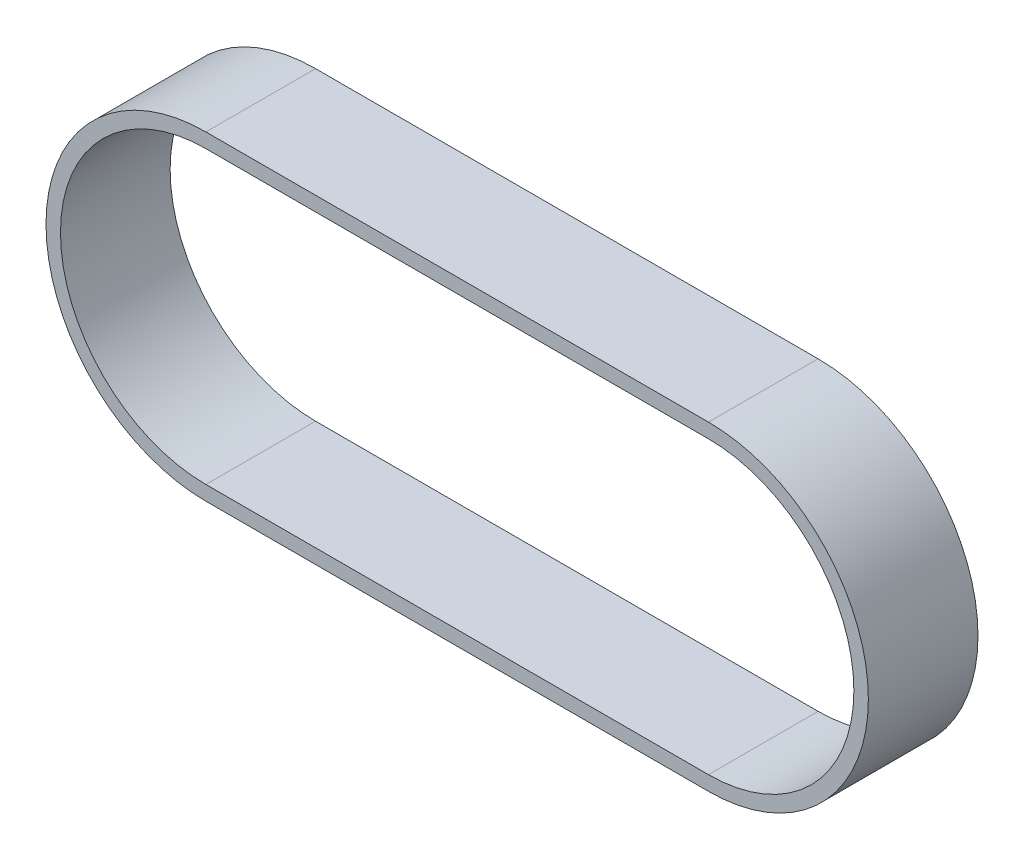
ISO-10303-21;
HEADER;
FILE_DESCRIPTION(('STEP AP214'),'2;1');
FILE_NAME('part.step','',(''),(''),'','','');
FILE_SCHEMA(('AUTOMOTIVE_DESIGN { 1 0 10303 214 1 1 1 1 }'));
ENDSEC;
DATA;
#1=APPLICATION_CONTEXT('core data for automotive mechanical design processes');
#2=APPLICATION_PROTOCOL_DEFINITION('international standard','automotive_design',2000,#1);
#3=PRODUCT_CONTEXT('',#1,'mechanical');
#4=PRODUCT('Part','Part','',(#3));
#5=PRODUCT_RELATED_PRODUCT_CATEGORY('part','',(#4));
#6=PRODUCT_DEFINITION_FORMATION('','',#4);
#7=PRODUCT_DEFINITION_CONTEXT('part definition',#1,'design');
#8=PRODUCT_DEFINITION('design','',#6,#7);
#9=PRODUCT_DEFINITION_SHAPE('','',#8);
#10=(LENGTH_UNIT() NAMED_UNIT(*) SI_UNIT(.MILLI.,.METRE.));
#11=(NAMED_UNIT(*) PLANE_ANGLE_UNIT() SI_UNIT($,.RADIAN.));
#12=(NAMED_UNIT(*) SI_UNIT($,.STERADIAN.) SOLID_ANGLE_UNIT());
#13=UNCERTAINTY_MEASURE_WITH_UNIT(LENGTH_MEASURE(1.E-05),#10,'distance_accuracy_value','');
#14=(GEOMETRIC_REPRESENTATION_CONTEXT(3) GLOBAL_UNCERTAINTY_ASSIGNED_CONTEXT((#13)) GLOBAL_UNIT_ASSIGNED_CONTEXT((#10,
#11,#12)) REPRESENTATION_CONTEXT('',''));
#15=CARTESIAN_POINT('',(0.,0.,0.));
#16=DIRECTION('',(0.,0.,1.));
#17=DIRECTION('',(1.,0.,0.));
#18=AXIS2_PLACEMENT_3D('',#15,#16,#17);
#19=CARTESIAN_POINT('',(0.,0.,12.));
#20=DIRECTION('',(0.,0.,1.));
#21=DIRECTION('',(1.,0.,0.));
#22=AXIS2_PLACEMENT_3D('',#19,#20,#21);
#23=PLANE('',#22);
#24=CARTESIAN_POINT('',(0.,0.,12.));
#25=DIRECTION('',(0.,0.,1.));
#26=DIRECTION('',(1.,0.,0.));
#27=AXIS2_PLACEMENT_3D('',#24,#25,#26);
#28=CIRCLE('',#27,17.5);
#29=CARTESIAN_POINT('',(0.,17.5,12.));
#30=VERTEX_POINT('',#29);
#31=CARTESIAN_POINT('',(0.,-17.5,12.));
#32=VERTEX_POINT('',#31);
#33=EDGE_CURVE('E134',#30,#32,#28,.T.);
#34=ORIENTED_EDGE('',*,*,#33,.T.);
#35=DIRECTION('',(1.,0.,0.));
#36=VECTOR('',#35,1.);
#37=CARTESIAN_POINT('',(0.,-17.5,12.));
#38=LINE('',#37,#36);
#39=CARTESIAN_POINT('',(55.,-17.5,12.));
#40=VERTEX_POINT('',#39);
#41=EDGE_CURVE('E137',#32,#40,#38,.T.);
#42=ORIENTED_EDGE('',*,*,#41,.T.);
#43=CARTESIAN_POINT('',(55.,0.,12.));
#44=DIRECTION('',(0.,0.,1.));
#45=DIRECTION('',(1.,0.,0.));
#46=AXIS2_PLACEMENT_3D('',#43,#44,#45);
#47=CIRCLE('',#46,17.5);
#48=CARTESIAN_POINT('',(55.,17.5,12.));
#49=VERTEX_POINT('',#48);
#50=EDGE_CURVE('E140',#40,#49,#47,.T.);
#51=ORIENTED_EDGE('',*,*,#50,.T.);
#52=DIRECTION('',(-1.,0.,0.));
#53=VECTOR('',#52,1.);
#54=CARTESIAN_POINT('',(0.,17.5,12.));
#55=LINE('',#54,#53);
#56=EDGE_CURVE('E142',#49,#30,#55,.T.);
#57=ORIENTED_EDGE('',*,*,#56,.T.);
#58=EDGE_LOOP('',(#34,#42,#51,#57));
#59=FACE_BOUND('',#58,.T.);
#60=DIRECTION('',(1.,0.,0.));
#61=VECTOR('',#60,1.);
#62=CARTESIAN_POINT('',(0.,-15.915,12.));
#63=LINE('',#62,#61);
#64=CARTESIAN_POINT('',(0.,-15.915,12.));
#65=VERTEX_POINT('',#64);
#66=CARTESIAN_POINT('',(55.,-15.915,12.));
#67=VERTEX_POINT('',#66);
#68=EDGE_CURVE('E106',#65,#67,#63,.T.);
#69=ORIENTED_EDGE('',*,*,#68,.F.);
#70=CARTESIAN_POINT('',(0.,0.,12.));
#71=DIRECTION('',(0.,0.,1.));
#72=DIRECTION('',(1.,0.,0.));
#73=AXIS2_PLACEMENT_3D('',#70,#71,#72);
#74=CIRCLE('',#73,15.915);
#75=CARTESIAN_POINT('',(0.,15.915,12.));
#76=VERTEX_POINT('',#75);
#77=EDGE_CURVE('E98',#76,#65,#74,.T.);
#78=ORIENTED_EDGE('',*,*,#77,.F.);
#79=DIRECTION('',(-1.,0.,0.));
#80=VECTOR('',#79,1.);
#81=CARTESIAN_POINT('',(0.,15.915,12.));
#82=LINE('',#81,#80);
#83=CARTESIAN_POINT('',(55.,15.915,12.));
#84=VERTEX_POINT('',#83);
#85=EDGE_CURVE('E120',#84,#76,#82,.T.);
#86=ORIENTED_EDGE('',*,*,#85,.F.);
#87=CARTESIAN_POINT('',(55.,0.,12.));
#88=DIRECTION('',(0.,0.,1.));
#89=DIRECTION('',(1.,0.,0.));
#90=AXIS2_PLACEMENT_3D('',#87,#88,#89);
#91=CIRCLE('',#90,15.915);
#92=EDGE_CURVE('E118',#67,#84,#91,.T.);
#93=ORIENTED_EDGE('',*,*,#92,.F.);
#94=EDGE_LOOP('',(#69,#78,#86,#93));
#95=FACE_BOUND('',#94,.T.);
#96=ADVANCED_FACE('F33',(#59,#95),#23,.T.);
#97=CARTESIAN_POINT('',(0.,0.,0.));
#98=DIRECTION('',(0.,0.,1.));
#99=DIRECTION('',(1.,0.,0.));
#100=AXIS2_PLACEMENT_3D('',#97,#98,#99);
#101=PLANE('',#100);
#102=CARTESIAN_POINT('',(0.,0.,0.));
#103=DIRECTION('',(0.,0.,1.));
#104=DIRECTION('',(1.,0.,0.));
#105=AXIS2_PLACEMENT_3D('',#102,#103,#104);
#106=CIRCLE('',#105,17.5);
#107=CARTESIAN_POINT('',(0.,17.5,0.));
#108=VERTEX_POINT('',#107);
#109=CARTESIAN_POINT('',(0.,-17.5,0.));
#110=VERTEX_POINT('',#109);
#111=EDGE_CURVE('E114',#108,#110,#106,.T.);
#112=ORIENTED_EDGE('',*,*,#111,.F.);
#113=DIRECTION('',(-1.,0.,0.));
#114=VECTOR('',#113,1.);
#115=CARTESIAN_POINT('',(0.,17.5,0.));
#116=LINE('',#115,#114);
#117=CARTESIAN_POINT('',(55.,17.5,0.));
#118=VERTEX_POINT('',#117);
#119=EDGE_CURVE('E138',#118,#108,#116,.T.);
#120=ORIENTED_EDGE('',*,*,#119,.F.);
#121=CARTESIAN_POINT('',(55.,0.,0.));
#122=DIRECTION('',(0.,0.,1.));
#123=DIRECTION('',(1.,0.,0.));
#124=AXIS2_PLACEMENT_3D('',#121,#122,#123);
#125=CIRCLE('',#124,17.5);
#126=CARTESIAN_POINT('',(55.,-17.5,0.));
#127=VERTEX_POINT('',#126);
#128=EDGE_CURVE('E149',#127,#118,#125,.T.);
#129=ORIENTED_EDGE('',*,*,#128,.F.);
#130=DIRECTION('',(1.,0.,0.));
#131=VECTOR('',#130,1.);
#132=CARTESIAN_POINT('',(0.,-17.5,0.));
#133=LINE('',#132,#131);
#134=EDGE_CURVE('E147',#110,#127,#133,.T.);
#135=ORIENTED_EDGE('',*,*,#134,.F.);
#136=EDGE_LOOP('',(#112,#120,#129,#135));
#137=FACE_BOUND('',#136,.T.);
#138=CARTESIAN_POINT('',(0.,0.,0.));
#139=DIRECTION('',(0.,0.,1.));
#140=DIRECTION('',(1.,0.,0.));
#141=AXIS2_PLACEMENT_3D('',#138,#139,#140);
#142=CIRCLE('',#141,15.915);
#143=CARTESIAN_POINT('',(0.,15.915,0.));
#144=VERTEX_POINT('',#143);
#145=CARTESIAN_POINT('',(0.,-15.915,0.));
#146=VERTEX_POINT('',#145);
#147=EDGE_CURVE('E56',#144,#146,#142,.T.);
#148=ORIENTED_EDGE('',*,*,#147,.T.);
#149=DIRECTION('',(1.,0.,0.));
#150=VECTOR('',#149,1.);
#151=CARTESIAN_POINT('',(0.,-15.915,0.));
#152=LINE('',#151,#150);
#153=CARTESIAN_POINT('',(55.,-15.915,0.));
#154=VERTEX_POINT('',#153);
#155=EDGE_CURVE('E113',#146,#154,#152,.T.);
#156=ORIENTED_EDGE('',*,*,#155,.T.);
#157=CARTESIAN_POINT('',(55.,0.,0.));
#158=DIRECTION('',(0.,0.,1.));
#159=DIRECTION('',(1.,0.,0.));
#160=AXIS2_PLACEMENT_3D('',#157,#158,#159);
#161=CIRCLE('',#160,15.915);
#162=CARTESIAN_POINT('',(55.,15.915,0.));
#163=VERTEX_POINT('',#162);
#164=EDGE_CURVE('E126',#154,#163,#161,.T.);
#165=ORIENTED_EDGE('',*,*,#164,.T.);
#166=DIRECTION('',(-1.,0.,0.));
#167=VECTOR('',#166,1.);
#168=CARTESIAN_POINT('',(0.,15.915,0.));
#169=LINE('',#168,#167);
#170=EDGE_CURVE('E107',#163,#144,#169,.T.);
#171=ORIENTED_EDGE('',*,*,#170,.T.);
#172=EDGE_LOOP('',(#148,#156,#165,#171));
#173=FACE_BOUND('',#172,.T.);
#174=ADVANCED_FACE('F167',(#137,#173),#101,.F.);
#175=CARTESIAN_POINT('',(0.,0.,12.));
#176=DIRECTION('',(0.,0.,-1.));
#177=DIRECTION('',(-1.,0.,0.));
#178=AXIS2_PLACEMENT_3D('',#175,#176,#177);
#179=CYLINDRICAL_SURFACE('',#178,17.5);
#180=ORIENTED_EDGE('',*,*,#111,.T.);
#181=DIRECTION('',(0.,0.,-1.));
#182=VECTOR('',#181,1.);
#183=CARTESIAN_POINT('',(0.,-17.5,12.));
#184=LINE('',#183,#182);
#185=EDGE_CURVE('E11',#32,#110,#184,.T.);
#186=ORIENTED_EDGE('',*,*,#185,.F.);
#187=ORIENTED_EDGE('',*,*,#33,.F.);
#188=DIRECTION('',(0.,0.,-1.));
#189=VECTOR('',#188,1.);
#190=CARTESIAN_POINT('',(0.,17.5,12.));
#191=LINE('',#190,#189);
#192=EDGE_CURVE('E144',#30,#108,#191,.T.);
#193=ORIENTED_EDGE('',*,*,#192,.T.);
#194=EDGE_LOOP('',(#180,#186,#187,#193));
#195=FACE_BOUND('',#194,.T.);
#196=ADVANCED_FACE('F35',(#195),#179,.T.);
#197=CARTESIAN_POINT('',(0.,-17.5,12.));
#198=DIRECTION('',(0.,1.,0.));
#199=DIRECTION('',(-1.,0.,0.));
#200=AXIS2_PLACEMENT_3D('',#197,#198,#199);
#201=PLANE('',#200);
#202=ORIENTED_EDGE('',*,*,#134,.T.);
#203=DIRECTION('',(0.,0.,-1.));
#204=VECTOR('',#203,1.);
#205=CARTESIAN_POINT('',(55.,-17.5,12.));
#206=LINE('',#205,#204);
#207=EDGE_CURVE('E41',#40,#127,#206,.T.);
#208=ORIENTED_EDGE('',*,*,#207,.F.);
#209=ORIENTED_EDGE('',*,*,#41,.F.);
#210=ORIENTED_EDGE('',*,*,#185,.T.);
#211=EDGE_LOOP('',(#202,#208,#209,#210));
#212=FACE_BOUND('',#211,.T.);
#213=ADVANCED_FACE('F177',(#212),#201,.F.);
#214=CARTESIAN_POINT('',(55.,0.,12.));
#215=DIRECTION('',(0.,0.,-1.));
#216=DIRECTION('',(-1.,0.,0.));
#217=AXIS2_PLACEMENT_3D('',#214,#215,#216);
#218=CYLINDRICAL_SURFACE('',#217,17.5);
#219=ORIENTED_EDGE('',*,*,#128,.T.);
#220=DIRECTION('',(0.,0.,-1.));
#221=VECTOR('',#220,1.);
#222=CARTESIAN_POINT('',(55.,17.5,12.));
#223=LINE('',#222,#221);
#224=EDGE_CURVE('E154',#49,#118,#223,.T.);
#225=ORIENTED_EDGE('',*,*,#224,.F.);
#226=ORIENTED_EDGE('',*,*,#50,.F.);
#227=ORIENTED_EDGE('',*,*,#207,.T.);
#228=EDGE_LOOP('',(#219,#225,#226,#227));
#229=FACE_BOUND('',#228,.T.);
#230=ADVANCED_FACE('F161',(#229),#218,.T.);
#231=CARTESIAN_POINT('',(0.,17.5,12.));
#232=DIRECTION('',(0.,-1.,0.));
#233=DIRECTION('',(1.,0.,0.));
#234=AXIS2_PLACEMENT_3D('',#231,#232,#233);
#235=PLANE('',#234);
#236=ORIENTED_EDGE('',*,*,#119,.T.);
#237=ORIENTED_EDGE('',*,*,#192,.F.);
#238=ORIENTED_EDGE('',*,*,#56,.F.);
#239=ORIENTED_EDGE('',*,*,#224,.T.);
#240=EDGE_LOOP('',(#236,#237,#238,#239));
#241=FACE_BOUND('',#240,.T.);
#242=ADVANCED_FACE('F171',(#241),#235,.F.);
#243=CARTESIAN_POINT('',(0.,0.,12.));
#244=DIRECTION('',(0.,0.,-1.));
#245=DIRECTION('',(-1.,0.,0.));
#246=AXIS2_PLACEMENT_3D('',#243,#244,#245);
#247=CYLINDRICAL_SURFACE('',#246,15.915);
#248=ORIENTED_EDGE('',*,*,#147,.F.);
#249=DIRECTION('',(0.,0.,-1.));
#250=VECTOR('',#249,1.);
#251=CARTESIAN_POINT('',(0.,15.915,12.));
#252=LINE('',#251,#250);
#253=EDGE_CURVE('E102',#76,#144,#252,.T.);
#254=ORIENTED_EDGE('',*,*,#253,.F.);
#255=ORIENTED_EDGE('',*,*,#77,.T.);
#256=DIRECTION('',(0.,0.,-1.));
#257=VECTOR('',#256,1.);
#258=CARTESIAN_POINT('',(0.,-15.915,12.));
#259=LINE('',#258,#257);
#260=EDGE_CURVE('E101',#65,#146,#259,.T.);
#261=ORIENTED_EDGE('',*,*,#260,.T.);
#262=EDGE_LOOP('',(#248,#254,#255,#261));
#263=FACE_BOUND('',#262,.T.);
#264=ADVANCED_FACE('F100',(#263),#247,.F.);
#265=CARTESIAN_POINT('',(0.,-15.915,12.));
#266=DIRECTION('',(0.,1.,0.));
#267=DIRECTION('',(0.,0.,1.));
#268=AXIS2_PLACEMENT_3D('',#265,#266,#267);
#269=PLANE('',#268);
#270=ORIENTED_EDGE('',*,*,#155,.F.);
#271=ORIENTED_EDGE('',*,*,#260,.F.);
#272=ORIENTED_EDGE('',*,*,#68,.T.);
#273=DIRECTION('',(0.,0.,-1.));
#274=VECTOR('',#273,1.);
#275=CARTESIAN_POINT('',(55.,-15.915,12.));
#276=LINE('',#275,#274);
#277=EDGE_CURVE('E115',#67,#154,#276,.T.);
#278=ORIENTED_EDGE('',*,*,#277,.T.);
#279=EDGE_LOOP('',(#270,#271,#272,#278));
#280=FACE_BOUND('',#279,.T.);
#281=ADVANCED_FACE('F110',(#280),#269,.T.);
#282=CARTESIAN_POINT('',(55.,0.,12.));
#283=DIRECTION('',(0.,0.,-1.));
#284=DIRECTION('',(-1.,0.,0.));
#285=AXIS2_PLACEMENT_3D('',#282,#283,#284);
#286=CYLINDRICAL_SURFACE('',#285,15.915);
#287=ORIENTED_EDGE('',*,*,#164,.F.);
#288=ORIENTED_EDGE('',*,*,#277,.F.);
#289=ORIENTED_EDGE('',*,*,#92,.T.);
#290=DIRECTION('',(0.,0.,-1.));
#291=VECTOR('',#290,1.);
#292=CARTESIAN_POINT('',(55.,15.915,12.));
#293=LINE('',#292,#291);
#294=EDGE_CURVE('E48',#84,#163,#293,.T.);
#295=ORIENTED_EDGE('',*,*,#294,.T.);
#296=EDGE_LOOP('',(#287,#288,#289,#295));
#297=FACE_BOUND('',#296,.T.);
#298=ADVANCED_FACE('F200',(#297),#286,.F.);
#299=CARTESIAN_POINT('',(0.,15.915,12.));
#300=DIRECTION('',(0.,-1.,0.));
#301=DIRECTION('',(0.,0.,-1.));
#302=AXIS2_PLACEMENT_3D('',#299,#300,#301);
#303=PLANE('',#302);
#304=ORIENTED_EDGE('',*,*,#170,.F.);
#305=ORIENTED_EDGE('',*,*,#294,.F.);
#306=ORIENTED_EDGE('',*,*,#85,.T.);
#307=ORIENTED_EDGE('',*,*,#253,.T.);
#308=EDGE_LOOP('',(#304,#305,#306,#307));
#309=FACE_BOUND('',#308,.T.);
#310=ADVANCED_FACE('F204',(#309),#303,.T.);
#311=CLOSED_SHELL('',(#96,#174,#196,#213,#230,#242,#264,#281,#298,#310));
#312=MANIFOLD_SOLID_BREP('B2',#311);
#313=ADVANCED_BREP_SHAPE_REPRESENTATION('',(#18,#312),#14);
#314=SHAPE_DEFINITION_REPRESENTATION(#9,#313);
ENDSEC;
END-ISO-10303-21;
